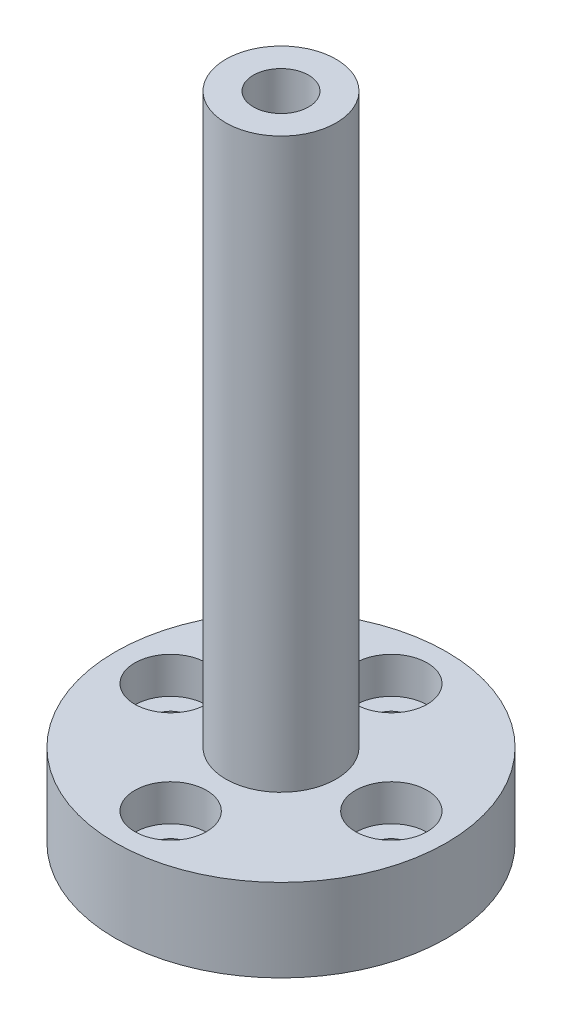
ISO-10303-21;
HEADER;
FILE_DESCRIPTION(('STEP AP214'),'2;1');
FILE_NAME('part.step','',(''),(''),'','','');
FILE_SCHEMA(('AUTOMOTIVE_DESIGN { 1 0 10303 214 1 1 1 1 }'));
ENDSEC;
DATA;
#1=APPLICATION_CONTEXT('core data for automotive mechanical design processes');
#2=APPLICATION_PROTOCOL_DEFINITION('international standard','automotive_design',2000,#1);
#3=PRODUCT_CONTEXT('',#1,'mechanical');
#4=PRODUCT('Part','Part','',(#3));
#5=PRODUCT_RELATED_PRODUCT_CATEGORY('part','',(#4));
#6=PRODUCT_DEFINITION_FORMATION('','',#4);
#7=PRODUCT_DEFINITION_CONTEXT('part definition',#1,'design');
#8=PRODUCT_DEFINITION('design','',#6,#7);
#9=PRODUCT_DEFINITION_SHAPE('','',#8);
#10=(LENGTH_UNIT() NAMED_UNIT(*) SI_UNIT(.MILLI.,.METRE.));
#11=(NAMED_UNIT(*) PLANE_ANGLE_UNIT() SI_UNIT($,.RADIAN.));
#12=(NAMED_UNIT(*) SI_UNIT($,.STERADIAN.) SOLID_ANGLE_UNIT());
#13=UNCERTAINTY_MEASURE_WITH_UNIT(LENGTH_MEASURE(1.E-05),#10,'distance_accuracy_value','');
#14=(GEOMETRIC_REPRESENTATION_CONTEXT(3) GLOBAL_UNCERTAINTY_ASSIGNED_CONTEXT((#13)) GLOBAL_UNIT_ASSIGNED_CONTEXT((#10,
#11,#12)) REPRESENTATION_CONTEXT('',''));
#15=CARTESIAN_POINT('',(0.,0.,0.));
#16=DIRECTION('',(0.,0.,1.));
#17=DIRECTION('',(1.,0.,0.));
#18=AXIS2_PLACEMENT_3D('',#15,#16,#17);
#19=CARTESIAN_POINT('',(0.,15.,0.));
#20=DIRECTION('',(0.,-1.,0.));
#21=DIRECTION('',(0.,0.,-1.));
#22=AXIS2_PLACEMENT_3D('',#19,#20,#21);
#23=CYLINDRICAL_SURFACE('',#22,30.);
#24=CARTESIAN_POINT('',(0.,15.,0.));
#25=DIRECTION('',(0.,1.,0.));
#26=DIRECTION('',(0.,0.,1.));
#27=AXIS2_PLACEMENT_3D('',#24,#25,#26);
#28=CIRCLE('',#27,30.);
#29=CARTESIAN_POINT('',(0.,15.,30.));
#30=VERTEX_POINT('',#29);
#31=EDGE_CURVE('E39',#30,#30,#28,.T.);
#32=ORIENTED_EDGE('',*,*,#31,.F.);
#33=EDGE_LOOP('',(#32));
#34=FACE_BOUND('',#33,.T.);
#35=CARTESIAN_POINT('',(0.,0.,0.));
#36=DIRECTION('',(0.,1.,0.));
#37=DIRECTION('',(0.,0.,1.));
#38=AXIS2_PLACEMENT_3D('',#35,#36,#37);
#39=CIRCLE('',#38,30.);
#40=CARTESIAN_POINT('',(0.,0.,30.));
#41=VERTEX_POINT('',#40);
#42=EDGE_CURVE('E35',#41,#41,#39,.T.);
#43=ORIENTED_EDGE('',*,*,#42,.T.);
#44=EDGE_LOOP('',(#43));
#45=FACE_BOUND('',#44,.T.);
#46=ADVANCED_FACE('F32',(#34,#45),#23,.T.);
#47=CARTESIAN_POINT('',(0.,15.,0.));
#48=DIRECTION('',(0.,1.,0.));
#49=DIRECTION('',(0.,0.,1.));
#50=AXIS2_PLACEMENT_3D('',#47,#48,#49);
#51=PLANE('',#50);
#52=CARTESIAN_POINT('',(-20.,15.,0.));
#53=DIRECTION('',(0.,1.,0.));
#54=DIRECTION('',(-1.,0.,0.));
#55=AXIS2_PLACEMENT_3D('',#52,#53,#54);
#56=CIRCLE('',#55,6.5);
#57=CARTESIAN_POINT('',(-26.5,15.,0.));
#58=VERTEX_POINT('',#57);
#59=EDGE_CURVE('E103',#58,#58,#56,.T.);
#60=ORIENTED_EDGE('',*,*,#59,.F.);
#61=EDGE_LOOP('',(#60));
#62=FACE_BOUND('',#61,.T.);
#63=CARTESIAN_POINT('',(0.,15.,-20.));
#64=DIRECTION('',(0.,1.,0.));
#65=DIRECTION('',(0.,0.,-1.));
#66=AXIS2_PLACEMENT_3D('',#63,#64,#65);
#67=CIRCLE('',#66,6.5);
#68=CARTESIAN_POINT('',(0.,15.,-26.5));
#69=VERTEX_POINT('',#68);
#70=EDGE_CURVE('E93',#69,#69,#67,.T.);
#71=ORIENTED_EDGE('',*,*,#70,.F.);
#72=EDGE_LOOP('',(#71));
#73=FACE_BOUND('',#72,.T.);
#74=CARTESIAN_POINT('',(20.,15.,2.09488880330588E-13));
#75=DIRECTION('',(0.,1.,0.));
#76=DIRECTION('',(1.,0.,0.));
#77=AXIS2_PLACEMENT_3D('',#74,#75,#76);
#78=CIRCLE('',#77,6.5);
#79=CARTESIAN_POINT('',(26.5,15.,2.77572766438029E-13));
#80=VERTEX_POINT('',#79);
#81=EDGE_CURVE('E80',#80,#80,#78,.T.);
#82=ORIENTED_EDGE('',*,*,#81,.F.);
#83=EDGE_LOOP('',(#82));
#84=FACE_BOUND('',#83,.T.);
#85=CARTESIAN_POINT('',(0.,15.,20.));
#86=DIRECTION('',(0.,1.,0.));
#87=DIRECTION('',(0.,0.,1.));
#88=AXIS2_PLACEMENT_3D('',#85,#86,#87);
#89=CIRCLE('',#88,6.5);
#90=CARTESIAN_POINT('',(0.,15.,26.5));
#91=VERTEX_POINT('',#90);
#92=EDGE_CURVE('E61',#91,#91,#89,.T.);
#93=ORIENTED_EDGE('',*,*,#92,.F.);
#94=EDGE_LOOP('',(#93));
#95=FACE_BOUND('',#94,.T.);
#96=CARTESIAN_POINT('',(0.,15.,0.));
#97=DIRECTION('',(0.,1.,0.));
#98=DIRECTION('',(0.,0.,1.));
#99=AXIS2_PLACEMENT_3D('',#96,#97,#98);
#100=CIRCLE('',#99,10.);
#101=CARTESIAN_POINT('',(0.,15.,10.));
#102=VERTEX_POINT('',#101);
#103=EDGE_CURVE('E10',#102,#102,#100,.T.);
#104=ORIENTED_EDGE('',*,*,#103,.F.);
#105=EDGE_LOOP('',(#104));
#106=FACE_BOUND('',#105,.T.);
#107=ORIENTED_EDGE('',*,*,#31,.T.);
#108=EDGE_LOOP('',(#107));
#109=FACE_BOUND('',#108,.T.);
#110=ADVANCED_FACE('F131',(#62,#73,#84,#95,#106,#109),#51,.T.);
#111=CARTESIAN_POINT('',(0.,0.,0.));
#112=DIRECTION('',(0.,1.,0.));
#113=DIRECTION('',(0.,0.,1.));
#114=AXIS2_PLACEMENT_3D('',#111,#112,#113);
#115=PLANE('',#114);
#116=CARTESIAN_POINT('',(-20.,0.,0.));
#117=DIRECTION('',(0.,1.,0.));
#118=DIRECTION('',(-1.,0.,0.));
#119=AXIS2_PLACEMENT_3D('',#116,#117,#118);
#120=CIRCLE('',#119,3.2);
#121=CARTESIAN_POINT('',(-23.2,0.,0.));
#122=VERTEX_POINT('',#121);
#123=EDGE_CURVE('E89',#122,#122,#120,.T.);
#124=ORIENTED_EDGE('',*,*,#123,.T.);
#125=EDGE_LOOP('',(#124));
#126=FACE_BOUND('',#125,.T.);
#127=CARTESIAN_POINT('',(0.,0.,-20.));
#128=DIRECTION('',(0.,1.,0.));
#129=DIRECTION('',(0.,0.,-1.));
#130=AXIS2_PLACEMENT_3D('',#127,#128,#129);
#131=CIRCLE('',#130,3.2);
#132=CARTESIAN_POINT('',(0.,0.,-23.2));
#133=VERTEX_POINT('',#132);
#134=EDGE_CURVE('E76',#133,#133,#131,.T.);
#135=ORIENTED_EDGE('',*,*,#134,.T.);
#136=EDGE_LOOP('',(#135));
#137=FACE_BOUND('',#136,.T.);
#138=CARTESIAN_POINT('',(20.,0.,2.09488880330588E-13));
#139=DIRECTION('',(0.,1.,0.));
#140=DIRECTION('',(1.,0.,0.));
#141=AXIS2_PLACEMENT_3D('',#138,#139,#140);
#142=CIRCLE('',#141,3.2);
#143=CARTESIAN_POINT('',(23.2,0.,2.43007101183482E-13));
#144=VERTEX_POINT('',#143);
#145=EDGE_CURVE('E83',#144,#144,#142,.T.);
#146=ORIENTED_EDGE('',*,*,#145,.T.);
#147=EDGE_LOOP('',(#146));
#148=FACE_BOUND('',#147,.T.);
#149=CARTESIAN_POINT('',(0.,0.,20.));
#150=DIRECTION('',(0.,1.,0.));
#151=DIRECTION('',(0.,0.,1.));
#152=AXIS2_PLACEMENT_3D('',#149,#150,#151);
#153=CIRCLE('',#152,3.2);
#154=CARTESIAN_POINT('',(0.,0.,23.2));
#155=VERTEX_POINT('',#154);
#156=EDGE_CURVE('E64',#155,#155,#153,.T.);
#157=ORIENTED_EDGE('',*,*,#156,.T.);
#158=EDGE_LOOP('',(#157));
#159=FACE_BOUND('',#158,.T.);
#160=CARTESIAN_POINT('',(0.,0.,0.));
#161=DIRECTION('',(0.,-1.,0.));
#162=DIRECTION('',(0.,0.,-1.));
#163=AXIS2_PLACEMENT_3D('',#160,#161,#162);
#164=CIRCLE('',#163,7.25);
#165=CARTESIAN_POINT('',(0.,0.,-7.25));
#166=VERTEX_POINT('',#165);
#167=EDGE_CURVE('E49',#166,#166,#164,.T.);
#168=ORIENTED_EDGE('',*,*,#167,.F.);
#169=EDGE_LOOP('',(#168));
#170=FACE_BOUND('',#169,.T.);
#171=ORIENTED_EDGE('',*,*,#42,.F.);
#172=EDGE_LOOP('',(#171));
#173=FACE_BOUND('',#172,.T.);
#174=ADVANCED_FACE('F109',(#126,#137,#148,#159,#170,#173),#115,.F.);
#175=CARTESIAN_POINT('',(0.,118.,0.));
#176=DIRECTION('',(0.,-1.,0.));
#177=DIRECTION('',(0.,0.,-1.));
#178=AXIS2_PLACEMENT_3D('',#175,#176,#177);
#179=CYLINDRICAL_SURFACE('',#178,10.);
#180=CARTESIAN_POINT('',(0.,118.,0.));
#181=DIRECTION('',(0.,1.,0.));
#182=DIRECTION('',(0.,0.,1.));
#183=AXIS2_PLACEMENT_3D('',#180,#181,#182);
#184=CIRCLE('',#183,10.);
#185=CARTESIAN_POINT('',(0.,118.,10.));
#186=VERTEX_POINT('',#185);
#187=EDGE_CURVE('E45',#186,#186,#184,.T.);
#188=ORIENTED_EDGE('',*,*,#187,.F.);
#189=EDGE_LOOP('',(#188));
#190=FACE_BOUND('',#189,.T.);
#191=ORIENTED_EDGE('',*,*,#103,.T.);
#192=EDGE_LOOP('',(#191));
#193=FACE_BOUND('',#192,.T.);
#194=ADVANCED_FACE('F150',(#190,#193),#179,.T.);
#195=CARTESIAN_POINT('',(0.,118.,0.));
#196=DIRECTION('',(0.,1.,0.));
#197=DIRECTION('',(0.,0.,1.));
#198=AXIS2_PLACEMENT_3D('',#195,#196,#197);
#199=PLANE('',#198);
#200=CARTESIAN_POINT('',(0.,118.,0.));
#201=DIRECTION('',(0.,-1.,0.));
#202=DIRECTION('',(0.,0.,-1.));
#203=AXIS2_PLACEMENT_3D('',#200,#201,#202);
#204=CIRCLE('',#203,5.);
#205=CARTESIAN_POINT('',(0.,118.,-5.));
#206=VERTEX_POINT('',#205);
#207=EDGE_CURVE('E52',#206,#206,#204,.T.);
#208=ORIENTED_EDGE('',*,*,#207,.T.);
#209=EDGE_LOOP('',(#208));
#210=FACE_BOUND('',#209,.T.);
#211=ORIENTED_EDGE('',*,*,#187,.T.);
#212=EDGE_LOOP('',(#211));
#213=FACE_BOUND('',#212,.T.);
#214=ADVANCED_FACE('F154',(#210,#213),#199,.T.);
#215=CARTESIAN_POINT('',(0.,57.,0.));
#216=DIRECTION('',(0.,-1.,0.));
#217=DIRECTION('',(0.,0.,-1.));
#218=AXIS2_PLACEMENT_3D('',#215,#216,#217);
#219=CYLINDRICAL_SURFACE('',#218,7.25);
#220=CARTESIAN_POINT('',(0.,57.,0.));
#221=DIRECTION('',(0.,-1.,0.));
#222=DIRECTION('',(0.,0.,-1.));
#223=AXIS2_PLACEMENT_3D('',#220,#221,#222);
#224=CIRCLE('',#223,7.25);
#225=CARTESIAN_POINT('',(0.,57.,-7.25));
#226=VERTEX_POINT('',#225);
#227=EDGE_CURVE('E48',#226,#226,#224,.T.);
#228=ORIENTED_EDGE('',*,*,#227,.F.);
#229=EDGE_LOOP('',(#228));
#230=FACE_BOUND('',#229,.T.);
#231=ORIENTED_EDGE('',*,*,#167,.T.);
#232=EDGE_LOOP('',(#231));
#233=FACE_BOUND('',#232,.T.);
#234=ADVANCED_FACE('F160',(#230,#233),#219,.F.);
#235=CARTESIAN_POINT('',(0.,57.,0.));
#236=DIRECTION('',(0.,-1.,0.));
#237=DIRECTION('',(0.,0.,-1.));
#238=AXIS2_PLACEMENT_3D('',#235,#236,#237);
#239=PLANE('',#238);
#240=CARTESIAN_POINT('',(0.,57.,0.));
#241=DIRECTION('',(0.,-1.,0.));
#242=DIRECTION('',(0.,0.,-1.));
#243=AXIS2_PLACEMENT_3D('',#240,#241,#242);
#244=CIRCLE('',#243,5.);
#245=CARTESIAN_POINT('',(0.,57.,-5.));
#246=VERTEX_POINT('',#245);
#247=EDGE_CURVE('E55',#246,#246,#244,.T.);
#248=ORIENTED_EDGE('',*,*,#247,.F.);
#249=EDGE_LOOP('',(#248));
#250=FACE_BOUND('',#249,.T.);
#251=ORIENTED_EDGE('',*,*,#227,.T.);
#252=EDGE_LOOP('',(#251));
#253=FACE_BOUND('',#252,.T.);
#254=ADVANCED_FACE('F164',(#250,#253),#239,.T.);
#255=CARTESIAN_POINT('',(0.,118.,0.));
#256=DIRECTION('',(0.,-1.,0.));
#257=DIRECTION('',(0.,0.,-1.));
#258=AXIS2_PLACEMENT_3D('',#255,#256,#257);
#259=CYLINDRICAL_SURFACE('',#258,5.);
#260=ORIENTED_EDGE('',*,*,#207,.F.);
#261=EDGE_LOOP('',(#260));
#262=FACE_BOUND('',#261,.T.);
#263=ORIENTED_EDGE('',*,*,#247,.T.);
#264=EDGE_LOOP('',(#263));
#265=FACE_BOUND('',#264,.T.);
#266=ADVANCED_FACE('F168',(#262,#265),#259,.F.);
#267=CARTESIAN_POINT('',(0.,8.4,20.));
#268=DIRECTION('',(0.,1.,0.));
#269=DIRECTION('',(0.,0.,1.));
#270=AXIS2_PLACEMENT_3D('',#267,#268,#269);
#271=CYLINDRICAL_SURFACE('',#270,6.5);
#272=CARTESIAN_POINT('',(0.,8.4,20.));
#273=DIRECTION('',(0.,1.,0.));
#274=DIRECTION('',(0.,0.,1.));
#275=AXIS2_PLACEMENT_3D('',#272,#273,#274);
#276=CIRCLE('',#275,6.5);
#277=CARTESIAN_POINT('',(0.,8.4,26.5));
#278=VERTEX_POINT('',#277);
#279=EDGE_CURVE('E58',#278,#278,#276,.T.);
#280=ORIENTED_EDGE('',*,*,#279,.F.);
#281=EDGE_LOOP('',(#280));
#282=FACE_BOUND('',#281,.T.);
#283=ORIENTED_EDGE('',*,*,#92,.T.);
#284=EDGE_LOOP('',(#283));
#285=FACE_BOUND('',#284,.T.);
#286=ADVANCED_FACE('F172',(#282,#285),#271,.F.);
#287=CARTESIAN_POINT('',(0.,8.4,20.));
#288=DIRECTION('',(0.,1.,0.));
#289=DIRECTION('',(0.,0.,1.));
#290=AXIS2_PLACEMENT_3D('',#287,#288,#289);
#291=PLANE('',#290);
#292=CARTESIAN_POINT('',(0.,8.4,20.));
#293=DIRECTION('',(0.,1.,0.));
#294=DIRECTION('',(0.,0.,1.));
#295=AXIS2_PLACEMENT_3D('',#292,#293,#294);
#296=CIRCLE('',#295,3.2);
#297=CARTESIAN_POINT('',(0.,8.4,23.2));
#298=VERTEX_POINT('',#297);
#299=EDGE_CURVE('E67',#298,#298,#296,.T.);
#300=ORIENTED_EDGE('',*,*,#299,.F.);
#301=EDGE_LOOP('',(#300));
#302=FACE_BOUND('',#301,.T.);
#303=ORIENTED_EDGE('',*,*,#279,.T.);
#304=EDGE_LOOP('',(#303));
#305=FACE_BOUND('',#304,.T.);
#306=ADVANCED_FACE('F176',(#302,#305),#291,.T.);
#307=CARTESIAN_POINT('',(0.,0.,20.));
#308=DIRECTION('',(0.,1.,0.));
#309=DIRECTION('',(0.,0.,1.));
#310=AXIS2_PLACEMENT_3D('',#307,#308,#309);
#311=CYLINDRICAL_SURFACE('',#310,3.2);
#312=ORIENTED_EDGE('',*,*,#156,.F.);
#313=EDGE_LOOP('',(#312));
#314=FACE_BOUND('',#313,.T.);
#315=ORIENTED_EDGE('',*,*,#299,.T.);
#316=EDGE_LOOP('',(#315));
#317=FACE_BOUND('',#316,.T.);
#318=ADVANCED_FACE('F180',(#314,#317),#311,.F.);
#319=CARTESIAN_POINT('',(20.,8.4,2.09488880330588E-13));
#320=DIRECTION('',(0.,1.,0.));
#321=DIRECTION('',(1.,0.,0.));
#322=AXIS2_PLACEMENT_3D('',#319,#320,#321);
#323=CYLINDRICAL_SURFACE('',#322,6.5);
#324=CARTESIAN_POINT('',(20.,8.4,2.09488880330588E-13));
#325=DIRECTION('',(0.,1.,0.));
#326=DIRECTION('',(1.,0.,0.));
#327=AXIS2_PLACEMENT_3D('',#324,#325,#326);
#328=CIRCLE('',#327,6.5);
#329=CARTESIAN_POINT('',(26.5,8.4,2.77572766438029E-13));
#330=VERTEX_POINT('',#329);
#331=EDGE_CURVE('E73',#330,#330,#328,.T.);
#332=ORIENTED_EDGE('',*,*,#331,.F.);
#333=EDGE_LOOP('',(#332));
#334=FACE_BOUND('',#333,.T.);
#335=ORIENTED_EDGE('',*,*,#81,.T.);
#336=EDGE_LOOP('',(#335));
#337=FACE_BOUND('',#336,.T.);
#338=ADVANCED_FACE('F184',(#334,#337),#323,.F.);
#339=CARTESIAN_POINT('',(20.,8.4,2.09488880330588E-13));
#340=DIRECTION('',(0.,1.,0.));
#341=DIRECTION('',(1.,0.,0.));
#342=AXIS2_PLACEMENT_3D('',#339,#340,#341);
#343=PLANE('',#342);
#344=CARTESIAN_POINT('',(20.,8.4,2.09488880330588E-13));
#345=DIRECTION('',(0.,1.,0.));
#346=DIRECTION('',(1.,0.,0.));
#347=AXIS2_PLACEMENT_3D('',#344,#345,#346);
#348=CIRCLE('',#347,3.2);
#349=CARTESIAN_POINT('',(23.2,8.4,2.43007101183482E-13));
#350=VERTEX_POINT('',#349);
#351=EDGE_CURVE('E77',#350,#350,#348,.T.);
#352=ORIENTED_EDGE('',*,*,#351,.F.);
#353=EDGE_LOOP('',(#352));
#354=FACE_BOUND('',#353,.T.);
#355=ORIENTED_EDGE('',*,*,#331,.T.);
#356=EDGE_LOOP('',(#355));
#357=FACE_BOUND('',#356,.T.);
#358=ADVANCED_FACE('F188',(#354,#357),#343,.T.);
#359=CARTESIAN_POINT('',(20.,0.,2.09488880330588E-13));
#360=DIRECTION('',(0.,1.,0.));
#361=DIRECTION('',(1.,0.,0.));
#362=AXIS2_PLACEMENT_3D('',#359,#360,#361);
#363=CYLINDRICAL_SURFACE('',#362,3.2);
#364=ORIENTED_EDGE('',*,*,#145,.F.);
#365=EDGE_LOOP('',(#364));
#366=FACE_BOUND('',#365,.T.);
#367=ORIENTED_EDGE('',*,*,#351,.T.);
#368=EDGE_LOOP('',(#367));
#369=FACE_BOUND('',#368,.T.);
#370=ADVANCED_FACE('F192',(#366,#369),#363,.F.);
#371=CARTESIAN_POINT('',(0.,8.4,-20.));
#372=DIRECTION('',(0.,1.,0.));
#373=DIRECTION('',(0.,0.,-1.));
#374=AXIS2_PLACEMENT_3D('',#371,#372,#373);
#375=CYLINDRICAL_SURFACE('',#374,6.5);
#376=CARTESIAN_POINT('',(0.,8.4,-20.));
#377=DIRECTION('',(0.,1.,0.));
#378=DIRECTION('',(0.,0.,-1.));
#379=AXIS2_PLACEMENT_3D('',#376,#377,#378);
#380=CIRCLE('',#379,6.5);
#381=CARTESIAN_POINT('',(0.,8.4,-26.5));
#382=VERTEX_POINT('',#381);
#383=EDGE_CURVE('E86',#382,#382,#380,.T.);
#384=ORIENTED_EDGE('',*,*,#383,.F.);
#385=EDGE_LOOP('',(#384));
#386=FACE_BOUND('',#385,.T.);
#387=ORIENTED_EDGE('',*,*,#70,.T.);
#388=EDGE_LOOP('',(#387));
#389=FACE_BOUND('',#388,.T.);
#390=ADVANCED_FACE('F196',(#386,#389),#375,.F.);
#391=CARTESIAN_POINT('',(0.,8.4,-20.));
#392=DIRECTION('',(0.,1.,0.));
#393=DIRECTION('',(0.,0.,-1.));
#394=AXIS2_PLACEMENT_3D('',#391,#392,#393);
#395=PLANE('',#394);
#396=CARTESIAN_POINT('',(0.,8.4,-20.));
#397=DIRECTION('',(0.,1.,0.));
#398=DIRECTION('',(0.,0.,-1.));
#399=AXIS2_PLACEMENT_3D('',#396,#397,#398);
#400=CIRCLE('',#399,3.2);
#401=CARTESIAN_POINT('',(0.,8.4,-23.2));
#402=VERTEX_POINT('',#401);
#403=EDGE_CURVE('E90',#402,#402,#400,.T.);
#404=ORIENTED_EDGE('',*,*,#403,.F.);
#405=EDGE_LOOP('',(#404));
#406=FACE_BOUND('',#405,.T.);
#407=ORIENTED_EDGE('',*,*,#383,.T.);
#408=EDGE_LOOP('',(#407));
#409=FACE_BOUND('',#408,.T.);
#410=ADVANCED_FACE('F200',(#406,#409),#395,.T.);
#411=CARTESIAN_POINT('',(0.,0.,-20.));
#412=DIRECTION('',(0.,1.,0.));
#413=DIRECTION('',(0.,0.,-1.));
#414=AXIS2_PLACEMENT_3D('',#411,#412,#413);
#415=CYLINDRICAL_SURFACE('',#414,3.2);
#416=ORIENTED_EDGE('',*,*,#134,.F.);
#417=EDGE_LOOP('',(#416));
#418=FACE_BOUND('',#417,.T.);
#419=ORIENTED_EDGE('',*,*,#403,.T.);
#420=EDGE_LOOP('',(#419));
#421=FACE_BOUND('',#420,.T.);
#422=ADVANCED_FACE('F127',(#418,#421),#415,.F.);
#423=CARTESIAN_POINT('',(-20.,8.4,0.));
#424=DIRECTION('',(0.,1.,0.));
#425=DIRECTION('',(-1.,0.,0.));
#426=AXIS2_PLACEMENT_3D('',#423,#424,#425);
#427=CYLINDRICAL_SURFACE('',#426,6.5);
#428=CARTESIAN_POINT('',(-20.,8.4,0.));
#429=DIRECTION('',(0.,1.,0.));
#430=DIRECTION('',(-1.,0.,0.));
#431=AXIS2_PLACEMENT_3D('',#428,#429,#430);
#432=CIRCLE('',#431,6.5);
#433=CARTESIAN_POINT('',(-26.5,8.4,0.));
#434=VERTEX_POINT('',#433);
#435=EDGE_CURVE('E70',#434,#434,#432,.T.);
#436=ORIENTED_EDGE('',*,*,#435,.F.);
#437=EDGE_LOOP('',(#436));
#438=FACE_BOUND('',#437,.T.);
#439=ORIENTED_EDGE('',*,*,#59,.T.);
#440=EDGE_LOOP('',(#439));
#441=FACE_BOUND('',#440,.T.);
#442=ADVANCED_FACE('F121',(#438,#441),#427,.F.);
#443=CARTESIAN_POINT('',(-20.,8.4,0.));
#444=DIRECTION('',(0.,1.,0.));
#445=DIRECTION('',(-1.,0.,0.));
#446=AXIS2_PLACEMENT_3D('',#443,#444,#445);
#447=PLANE('',#446);
#448=CARTESIAN_POINT('',(-20.,8.4,0.));
#449=DIRECTION('',(0.,1.,0.));
#450=DIRECTION('',(-1.,0.,0.));
#451=AXIS2_PLACEMENT_3D('',#448,#449,#450);
#452=CIRCLE('',#451,3.2);
#453=CARTESIAN_POINT('',(-23.2,8.4,0.));
#454=VERTEX_POINT('',#453);
#455=EDGE_CURVE('E100',#454,#454,#452,.T.);
#456=ORIENTED_EDGE('',*,*,#455,.F.);
#457=EDGE_LOOP('',(#456));
#458=FACE_BOUND('',#457,.T.);
#459=ORIENTED_EDGE('',*,*,#435,.T.);
#460=EDGE_LOOP('',(#459));
#461=FACE_BOUND('',#460,.T.);
#462=ADVANCED_FACE('F115',(#458,#461),#447,.T.);
#463=CARTESIAN_POINT('',(-20.,0.,0.));
#464=DIRECTION('',(0.,1.,0.));
#465=DIRECTION('',(-1.,0.,0.));
#466=AXIS2_PLACEMENT_3D('',#463,#464,#465);
#467=CYLINDRICAL_SURFACE('',#466,3.2);
#468=ORIENTED_EDGE('',*,*,#123,.F.);
#469=EDGE_LOOP('',(#468));
#470=FACE_BOUND('',#469,.T.);
#471=ORIENTED_EDGE('',*,*,#455,.T.);
#472=EDGE_LOOP('',(#471));
#473=FACE_BOUND('',#472,.T.);
#474=ADVANCED_FACE('F112',(#470,#473),#467,.F.);
#475=CLOSED_SHELL('',(#46,#110,#174,#194,#214,#234,#254,#266,#286,#306,#318,#338,#358,#370,#390,
#410,#422,#442,#462,#474));
#476=MANIFOLD_SOLID_BREP('B2',#475);
#477=ADVANCED_BREP_SHAPE_REPRESENTATION('',(#18,#476),#14);
#478=SHAPE_DEFINITION_REPRESENTATION(#9,#477);
ENDSEC;
END-ISO-10303-21;
